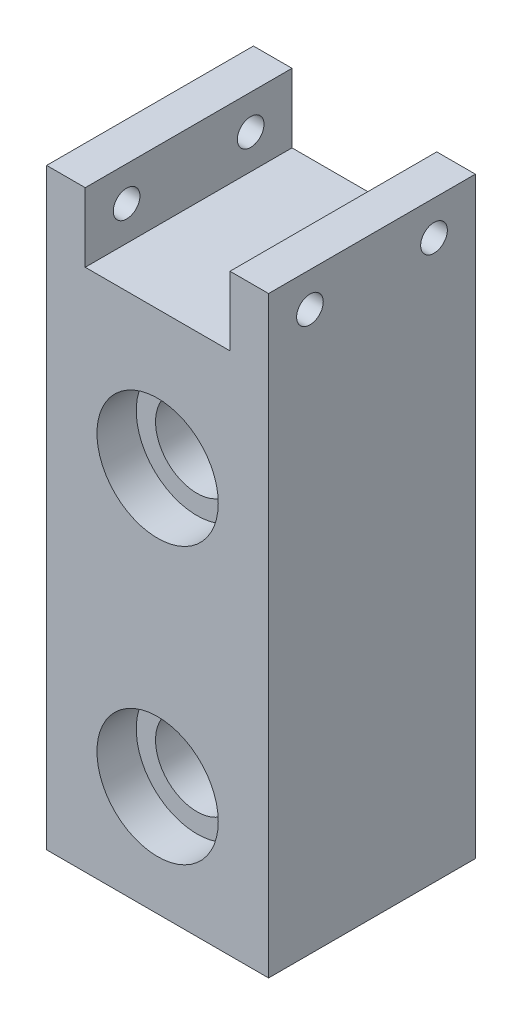
ISO-10303-21;
HEADER;
FILE_DESCRIPTION(('STEP AP214'),'2;1');
FILE_NAME('part.step','',(''),(''),'','','');
FILE_SCHEMA(('AUTOMOTIVE_DESIGN { 1 0 10303 214 1 1 1 1 }'));
ENDSEC;
DATA;
#1=APPLICATION_CONTEXT('core data for automotive mechanical design processes');
#2=APPLICATION_PROTOCOL_DEFINITION('international standard','automotive_design',2000,#1);
#3=PRODUCT_CONTEXT('',#1,'mechanical');
#4=PRODUCT('Part','Part','',(#3));
#5=PRODUCT_RELATED_PRODUCT_CATEGORY('part','',(#4));
#6=PRODUCT_DEFINITION_FORMATION('','',#4);
#7=PRODUCT_DEFINITION_CONTEXT('part definition',#1,'design');
#8=PRODUCT_DEFINITION('design','',#6,#7);
#9=PRODUCT_DEFINITION_SHAPE('','',#8);
#10=(LENGTH_UNIT() NAMED_UNIT(*) SI_UNIT(.MILLI.,.METRE.));
#11=(NAMED_UNIT(*) PLANE_ANGLE_UNIT() SI_UNIT($,.RADIAN.));
#12=(NAMED_UNIT(*) SI_UNIT($,.STERADIAN.) SOLID_ANGLE_UNIT());
#13=UNCERTAINTY_MEASURE_WITH_UNIT(LENGTH_MEASURE(1.E-05),#10,'distance_accuracy_value','');
#14=(GEOMETRIC_REPRESENTATION_CONTEXT(3) GLOBAL_UNCERTAINTY_ASSIGNED_CONTEXT((#13)) GLOBAL_UNIT_ASSIGNED_CONTEXT((#10,
#11,#12)) REPRESENTATION_CONTEXT('',''));
#15=CARTESIAN_POINT('',(0.,0.,0.));
#16=DIRECTION('',(0.,0.,1.));
#17=DIRECTION('',(1.,0.,0.));
#18=AXIS2_PLACEMENT_3D('',#15,#16,#17);
#19=CARTESIAN_POINT('',(0.,-50.8,-40.602614690566));
#20=DIRECTION('',(0.,0.,1.));
#21=DIRECTION('',(1.,0.,0.));
#22=AXIS2_PLACEMENT_3D('',#19,#20,#21);
#23=CYLINDRICAL_SURFACE('',#22,7.62);
#24=CARTESIAN_POINT('',(0.,-50.8,-11.811));
#25=DIRECTION('',(0.,0.,1.));
#26=DIRECTION('',(1.,0.,0.));
#27=AXIS2_PLACEMENT_3D('',#24,#25,#26);
#28=CIRCLE('',#27,7.62);
#29=CARTESIAN_POINT('',(7.62,-50.8,-11.811));
#30=VERTEX_POINT('',#29);
#31=EDGE_CURVE('E171',#30,#30,#28,.F.);
#32=ORIENTED_EDGE('',*,*,#31,.T.);
#33=EDGE_LOOP('',(#32));
#34=FACE_BOUND('',#33,.T.);
#35=CARTESIAN_POINT('',(0.,-50.8,11.811));
#36=DIRECTION('',(0.,0.,1.));
#37=DIRECTION('',(1.,0.,0.));
#38=AXIS2_PLACEMENT_3D('',#35,#36,#37);
#39=CIRCLE('',#38,7.62);
#40=CARTESIAN_POINT('',(7.62,-50.8,11.811));
#41=VERTEX_POINT('',#40);
#42=EDGE_CURVE('E140',#41,#41,#39,.F.);
#43=ORIENTED_EDGE('',*,*,#42,.F.);
#44=EDGE_LOOP('',(#43));
#45=FACE_BOUND('',#44,.T.);
#46=ADVANCED_FACE('F37',(#34,#45),#23,.F.);
#47=CARTESIAN_POINT('',(0.,0.,-40.602614690566));
#48=DIRECTION('',(0.,0.,1.));
#49=DIRECTION('',(1.,0.,0.));
#50=AXIS2_PLACEMENT_3D('',#47,#48,#49);
#51=CYLINDRICAL_SURFACE('',#50,7.62);
#52=CARTESIAN_POINT('',(0.,0.,-11.811));
#53=DIRECTION('',(0.,0.,1.));
#54=DIRECTION('',(1.,0.,0.));
#55=AXIS2_PLACEMENT_3D('',#52,#53,#54);
#56=CIRCLE('',#55,7.62);
#57=CARTESIAN_POINT('',(7.62,0.,-11.811));
#58=VERTEX_POINT('',#57);
#59=EDGE_CURVE('E169',#58,#58,#56,.F.);
#60=ORIENTED_EDGE('',*,*,#59,.T.);
#61=EDGE_LOOP('',(#60));
#62=FACE_BOUND('',#61,.T.);
#63=CARTESIAN_POINT('',(0.,0.,11.811));
#64=DIRECTION('',(0.,0.,1.));
#65=DIRECTION('',(1.,0.,0.));
#66=AXIS2_PLACEMENT_3D('',#63,#64,#65);
#67=CIRCLE('',#66,7.62);
#68=CARTESIAN_POINT('',(7.62,0.,11.811));
#69=VERTEX_POINT('',#68);
#70=EDGE_CURVE('E163',#69,#69,#67,.F.);
#71=ORIENTED_EDGE('',*,*,#70,.F.);
#72=EDGE_LOOP('',(#71));
#73=FACE_BOUND('',#72,.T.);
#74=ADVANCED_FACE('F222',(#62,#73),#51,.F.);
#75=CARTESIAN_POINT('',(-13.335,25.4,19.05));
#76=DIRECTION('',(-1.,0.,0.));
#77=DIRECTION('',(0.,0.,1.));
#78=AXIS2_PLACEMENT_3D('',#75,#76,#77);
#79=PLANE('',#78);
#80=CARTESIAN_POINT('',(-13.335,31.75,-11.43));
#81=DIRECTION('',(-1.,0.,0.));
#82=DIRECTION('',(0.,0.,1.));
#83=AXIS2_PLACEMENT_3D('',#80,#81,#82);
#84=CIRCLE('',#83,2.45744999999999);
#85=CARTESIAN_POINT('',(-13.335,31.75,-8.97255000000002));
#86=VERTEX_POINT('',#85);
#87=EDGE_CURVE('E321',#86,#86,#84,.T.);
#88=ORIENTED_EDGE('',*,*,#87,.T.);
#89=EDGE_LOOP('',(#88));
#90=FACE_BOUND('',#89,.T.);
#91=CARTESIAN_POINT('',(-13.335,31.75,11.43));
#92=DIRECTION('',(-1.,0.,0.));
#93=DIRECTION('',(0.,0.,1.));
#94=AXIS2_PLACEMENT_3D('',#91,#92,#93);
#95=CIRCLE('',#94,2.45744999999999);
#96=CARTESIAN_POINT('',(-13.335,31.75,13.88745));
#97=VERTEX_POINT('',#96);
#98=EDGE_CURVE('E249',#97,#97,#95,.T.);
#99=ORIENTED_EDGE('',*,*,#98,.T.);
#100=EDGE_LOOP('',(#99));
#101=FACE_BOUND('',#100,.T.);
#102=DIRECTION('',(0.,1.,0.));
#103=VECTOR('',#102,1.);
#104=CARTESIAN_POINT('',(-13.335,25.4,-19.05));
#105=LINE('',#104,#103);
#106=CARTESIAN_POINT('',(-13.335,25.4,-19.05));
#107=VERTEX_POINT('',#106);
#108=CARTESIAN_POINT('',(-13.335,38.1,-19.05));
#109=VERTEX_POINT('',#108);
#110=EDGE_CURVE('E136',#107,#109,#105,.T.);
#111=ORIENTED_EDGE('',*,*,#110,.T.);
#112=DIRECTION('',(0.,0.,-1.));
#113=VECTOR('',#112,1.);
#114=CARTESIAN_POINT('',(-13.335,38.1,19.05));
#115=LINE('',#114,#113);
#116=CARTESIAN_POINT('',(-13.335,38.1,19.05));
#117=VERTEX_POINT('',#116);
#118=EDGE_CURVE('E11',#117,#109,#115,.T.);
#119=ORIENTED_EDGE('',*,*,#118,.F.);
#120=DIRECTION('',(0.,1.,0.));
#121=VECTOR('',#120,1.);
#122=CARTESIAN_POINT('',(-13.335,25.4,19.05));
#123=LINE('',#122,#121);
#124=CARTESIAN_POINT('',(-13.335,25.4,19.05));
#125=VERTEX_POINT('',#124);
#126=EDGE_CURVE('E151',#125,#117,#123,.T.);
#127=ORIENTED_EDGE('',*,*,#126,.F.);
#128=DIRECTION('',(0.,0.,-1.));
#129=VECTOR('',#128,1.);
#130=CARTESIAN_POINT('',(-13.335,25.4,19.05));
#131=LINE('',#130,#129);
#132=EDGE_CURVE('E132',#125,#107,#131,.T.);
#133=ORIENTED_EDGE('',*,*,#132,.T.);
#134=EDGE_LOOP('',(#111,#119,#127,#133));
#135=FACE_BOUND('',#134,.T.);
#136=ADVANCED_FACE('F39',(#90,#101,#135),#79,.F.);
#137=CARTESIAN_POINT('',(-13.335,38.1,19.05));
#138=DIRECTION('',(0.,-1.,0.));
#139=DIRECTION('',(0.,0.,-1.));
#140=AXIS2_PLACEMENT_3D('',#137,#138,#139);
#141=PLANE('',#140);
#142=DIRECTION('',(-1.,0.,0.));
#143=VECTOR('',#142,1.);
#144=CARTESIAN_POINT('',(-13.335,38.1,-19.05));
#145=LINE('',#144,#143);
#146=CARTESIAN_POINT('',(-20.447,38.1,-19.05));
#147=VERTEX_POINT('',#146);
#148=EDGE_CURVE('E139',#109,#147,#145,.T.);
#149=ORIENTED_EDGE('',*,*,#148,.T.);
#150=DIRECTION('',(0.,0.,-1.));
#151=VECTOR('',#150,1.);
#152=CARTESIAN_POINT('',(-20.447,38.1,19.05));
#153=LINE('',#152,#151);
#154=CARTESIAN_POINT('',(-20.447,38.1,19.05));
#155=VERTEX_POINT('',#154);
#156=EDGE_CURVE('E47',#155,#147,#153,.T.);
#157=ORIENTED_EDGE('',*,*,#156,.F.);
#158=DIRECTION('',(-1.,0.,0.));
#159=VECTOR('',#158,1.);
#160=CARTESIAN_POINT('',(-13.335,38.1,19.05));
#161=LINE('',#160,#159);
#162=EDGE_CURVE('E99',#117,#155,#161,.T.);
#163=ORIENTED_EDGE('',*,*,#162,.F.);
#164=ORIENTED_EDGE('',*,*,#118,.T.);
#165=EDGE_LOOP('',(#149,#157,#163,#164));
#166=FACE_BOUND('',#165,.T.);
#167=ADVANCED_FACE('F366',(#166),#141,.F.);
#168=CARTESIAN_POINT('',(-20.447,38.1,19.05));
#169=DIRECTION('',(1.,0.,0.));
#170=DIRECTION('',(0.,1.,0.));
#171=AXIS2_PLACEMENT_3D('',#168,#169,#170);
#172=PLANE('',#171);
#173=CARTESIAN_POINT('',(-20.4470000000001,31.75,-11.43));
#174=DIRECTION('',(1.,0.,0.));
#175=DIRECTION('',(0.,0.,-1.));
#176=AXIS2_PLACEMENT_3D('',#173,#174,#175);
#177=CIRCLE('',#176,2.45744999999999);
#178=CARTESIAN_POINT('',(-20.4470000000001,31.75,-13.88745));
#179=VERTEX_POINT('',#178);
#180=EDGE_CURVE('E318',#179,#179,#177,.T.);
#181=ORIENTED_EDGE('',*,*,#180,.T.);
#182=EDGE_LOOP('',(#181));
#183=FACE_BOUND('',#182,.T.);
#184=CARTESIAN_POINT('',(-20.4470000000001,31.75,11.43));
#185=DIRECTION('',(1.,0.,0.));
#186=DIRECTION('',(0.,0.,-1.));
#187=AXIS2_PLACEMENT_3D('',#184,#185,#186);
#188=CIRCLE('',#187,2.45744999999999);
#189=CARTESIAN_POINT('',(-20.4470000000001,31.75,8.97255000000002));
#190=VERTEX_POINT('',#189);
#191=EDGE_CURVE('E326',#190,#190,#188,.T.);
#192=ORIENTED_EDGE('',*,*,#191,.T.);
#193=EDGE_LOOP('',(#192));
#194=FACE_BOUND('',#193,.T.);
#195=DIRECTION('',(0.,-1.,0.));
#196=VECTOR('',#195,1.);
#197=CARTESIAN_POINT('',(-20.447,38.1,-19.05));
#198=LINE('',#197,#196);
#199=CARTESIAN_POINT('',(-20.447,-71.12,-19.05));
#200=VERTEX_POINT('',#199);
#201=EDGE_CURVE('E142',#147,#200,#198,.T.);
#202=ORIENTED_EDGE('',*,*,#201,.T.);
#203=DIRECTION('',(0.,0.,-1.));
#204=VECTOR('',#203,1.);
#205=CARTESIAN_POINT('',(-20.447,-71.12,19.05));
#206=LINE('',#205,#204);
#207=CARTESIAN_POINT('',(-20.447,-71.12,19.05));
#208=VERTEX_POINT('',#207);
#209=EDGE_CURVE('E158',#208,#200,#206,.T.);
#210=ORIENTED_EDGE('',*,*,#209,.F.);
#211=DIRECTION('',(0.,-1.,0.));
#212=VECTOR('',#211,1.);
#213=CARTESIAN_POINT('',(-20.447,38.1,19.05));
#214=LINE('',#213,#212);
#215=EDGE_CURVE('E189',#155,#208,#214,.T.);
#216=ORIENTED_EDGE('',*,*,#215,.F.);
#217=ORIENTED_EDGE('',*,*,#156,.T.);
#218=EDGE_LOOP('',(#202,#210,#216,#217));
#219=FACE_BOUND('',#218,.T.);
#220=ADVANCED_FACE('F361',(#183,#194,#219),#172,.F.);
#221=CARTESIAN_POINT('',(-20.447,-71.12,19.05));
#222=DIRECTION('',(0.,1.,0.));
#223=DIRECTION('',(0.,0.,1.));
#224=AXIS2_PLACEMENT_3D('',#221,#222,#223);
#225=PLANE('',#224);
#226=DIRECTION('',(1.,0.,0.));
#227=VECTOR('',#226,1.);
#228=CARTESIAN_POINT('',(-20.447,-71.12,-19.05));
#229=LINE('',#228,#227);
#230=CARTESIAN_POINT('',(20.447,-71.12,-19.05));
#231=VERTEX_POINT('',#230);
#232=EDGE_CURVE('E144',#200,#231,#229,.T.);
#233=ORIENTED_EDGE('',*,*,#232,.T.);
#234=DIRECTION('',(0.,0.,-1.));
#235=VECTOR('',#234,1.);
#236=CARTESIAN_POINT('',(20.447,-71.12,19.05));
#237=LINE('',#236,#235);
#238=CARTESIAN_POINT('',(20.447,-71.12,19.05));
#239=VERTEX_POINT('',#238);
#240=EDGE_CURVE('E155',#239,#231,#237,.T.);
#241=ORIENTED_EDGE('',*,*,#240,.F.);
#242=DIRECTION('',(1.,0.,0.));
#243=VECTOR('',#242,1.);
#244=CARTESIAN_POINT('',(-20.447,-71.12,19.05));
#245=LINE('',#244,#243);
#246=EDGE_CURVE('E191',#208,#239,#245,.T.);
#247=ORIENTED_EDGE('',*,*,#246,.F.);
#248=ORIENTED_EDGE('',*,*,#209,.T.);
#249=EDGE_LOOP('',(#233,#241,#247,#248));
#250=FACE_BOUND('',#249,.T.);
#251=ADVANCED_FACE('F197',(#250),#225,.F.);
#252=CARTESIAN_POINT('',(20.447,38.1,19.05));
#253=DIRECTION('',(-1.,0.,0.));
#254=DIRECTION('',(0.,-1.,0.));
#255=AXIS2_PLACEMENT_3D('',#252,#253,#254);
#256=PLANE('',#255);
#257=CARTESIAN_POINT('',(20.447,31.75,-11.43));
#258=DIRECTION('',(1.,0.,0.));
#259=DIRECTION('',(0.,0.,-1.));
#260=AXIS2_PLACEMENT_3D('',#257,#258,#259);
#261=CIRCLE('',#260,2.45744999999999);
#262=CARTESIAN_POINT('',(20.447,31.75,-13.88745));
#263=VERTEX_POINT('',#262);
#264=EDGE_CURVE('E502',#263,#263,#261,.T.);
#265=ORIENTED_EDGE('',*,*,#264,.F.);
#266=EDGE_LOOP('',(#265));
#267=FACE_BOUND('',#266,.T.);
#268=CARTESIAN_POINT('',(20.447,31.75,11.43));
#269=DIRECTION('',(1.,0.,0.));
#270=DIRECTION('',(0.,0.,-1.));
#271=AXIS2_PLACEMENT_3D('',#268,#269,#270);
#272=CIRCLE('',#271,2.45744999999999);
#273=CARTESIAN_POINT('',(20.447,31.75,8.97255000000002));
#274=VERTEX_POINT('',#273);
#275=EDGE_CURVE('E323',#274,#274,#272,.T.);
#276=ORIENTED_EDGE('',*,*,#275,.F.);
#277=EDGE_LOOP('',(#276));
#278=FACE_BOUND('',#277,.T.);
#279=DIRECTION('',(0.,1.,0.));
#280=VECTOR('',#279,1.);
#281=CARTESIAN_POINT('',(20.447,38.1,-19.05));
#282=LINE('',#281,#280);
#283=CARTESIAN_POINT('',(20.447,38.1,-19.05));
#284=VERTEX_POINT('',#283);
#285=EDGE_CURVE('E146',#231,#284,#282,.T.);
#286=ORIENTED_EDGE('',*,*,#285,.T.);
#287=DIRECTION('',(0.,0.,-1.));
#288=VECTOR('',#287,1.);
#289=CARTESIAN_POINT('',(20.447,38.1,19.05));
#290=LINE('',#289,#288);
#291=CARTESIAN_POINT('',(20.447,38.1,19.05));
#292=VERTEX_POINT('',#291);
#293=EDGE_CURVE('E127',#292,#284,#290,.T.);
#294=ORIENTED_EDGE('',*,*,#293,.F.);
#295=DIRECTION('',(0.,1.,0.));
#296=VECTOR('',#295,1.);
#297=CARTESIAN_POINT('',(20.447,38.1,19.05));
#298=LINE('',#297,#296);
#299=EDGE_CURVE('E118',#239,#292,#298,.T.);
#300=ORIENTED_EDGE('',*,*,#299,.F.);
#301=ORIENTED_EDGE('',*,*,#240,.T.);
#302=EDGE_LOOP('',(#286,#294,#300,#301));
#303=FACE_BOUND('',#302,.T.);
#304=ADVANCED_FACE('F201',(#267,#278,#303),#256,.F.);
#305=CARTESIAN_POINT('',(13.335,38.1,19.05));
#306=DIRECTION('',(0.,-1.,0.));
#307=DIRECTION('',(0.,0.,-1.));
#308=AXIS2_PLACEMENT_3D('',#305,#306,#307);
#309=PLANE('',#308);
#310=DIRECTION('',(-1.,0.,0.));
#311=VECTOR('',#310,1.);
#312=CARTESIAN_POINT('',(13.335,38.1,-19.05));
#313=LINE('',#312,#311);
#314=CARTESIAN_POINT('',(13.335,38.1,-19.05));
#315=VERTEX_POINT('',#314);
#316=EDGE_CURVE('E126',#284,#315,#313,.T.);
#317=ORIENTED_EDGE('',*,*,#316,.T.);
#318=DIRECTION('',(0.,0.,-1.));
#319=VECTOR('',#318,1.);
#320=CARTESIAN_POINT('',(13.335,38.1,19.05));
#321=LINE('',#320,#319);
#322=CARTESIAN_POINT('',(13.335,38.1,19.05));
#323=VERTEX_POINT('',#322);
#324=EDGE_CURVE('E123',#323,#315,#321,.T.);
#325=ORIENTED_EDGE('',*,*,#324,.F.);
#326=DIRECTION('',(-1.,0.,0.));
#327=VECTOR('',#326,1.);
#328=CARTESIAN_POINT('',(13.335,38.1,19.05));
#329=LINE('',#328,#327);
#330=EDGE_CURVE('E112',#292,#323,#329,.T.);
#331=ORIENTED_EDGE('',*,*,#330,.F.);
#332=ORIENTED_EDGE('',*,*,#293,.T.);
#333=EDGE_LOOP('',(#317,#325,#331,#332));
#334=FACE_BOUND('',#333,.T.);
#335=ADVANCED_FACE('F124',(#334),#309,.F.);
#336=CARTESIAN_POINT('',(13.335,25.4,19.05));
#337=DIRECTION('',(1.,0.,0.));
#338=DIRECTION('',(0.,0.,-1.));
#339=AXIS2_PLACEMENT_3D('',#336,#337,#338);
#340=PLANE('',#339);
#341=CARTESIAN_POINT('',(13.335,31.75,-11.43));
#342=DIRECTION('',(1.,0.,0.));
#343=DIRECTION('',(0.,0.,-1.));
#344=AXIS2_PLACEMENT_3D('',#341,#342,#343);
#345=CIRCLE('',#344,2.45744999999999);
#346=CARTESIAN_POINT('',(13.335,31.75,-13.88745));
#347=VERTEX_POINT('',#346);
#348=EDGE_CURVE('E41',#347,#347,#345,.T.);
#349=ORIENTED_EDGE('',*,*,#348,.T.);
#350=EDGE_LOOP('',(#349));
#351=FACE_BOUND('',#350,.T.);
#352=CARTESIAN_POINT('',(13.335,31.75,11.43));
#353=DIRECTION('',(1.,0.,0.));
#354=DIRECTION('',(0.,0.,-1.));
#355=AXIS2_PLACEMENT_3D('',#352,#353,#354);
#356=CIRCLE('',#355,2.45744999999999);
#357=CARTESIAN_POINT('',(13.335,31.75,8.97255000000002));
#358=VERTEX_POINT('',#357);
#359=EDGE_CURVE('E254',#358,#358,#356,.T.);
#360=ORIENTED_EDGE('',*,*,#359,.T.);
#361=EDGE_LOOP('',(#360));
#362=FACE_BOUND('',#361,.T.);
#363=DIRECTION('',(0.,-1.,0.));
#364=VECTOR('',#363,1.);
#365=CARTESIAN_POINT('',(13.335,25.4,-19.05));
#366=LINE('',#365,#364);
#367=CARTESIAN_POINT('',(13.335,25.4,-19.05));
#368=VERTEX_POINT('',#367);
#369=EDGE_CURVE('E85',#315,#368,#366,.T.);
#370=ORIENTED_EDGE('',*,*,#369,.T.);
#371=DIRECTION('',(0.,0.,-1.));
#372=VECTOR('',#371,1.);
#373=CARTESIAN_POINT('',(13.335,25.4,19.05));
#374=LINE('',#373,#372);
#375=CARTESIAN_POINT('',(13.335,25.4,19.05));
#376=VERTEX_POINT('',#375);
#377=EDGE_CURVE('E128',#376,#368,#374,.T.);
#378=ORIENTED_EDGE('',*,*,#377,.F.);
#379=DIRECTION('',(0.,-1.,0.));
#380=VECTOR('',#379,1.);
#381=CARTESIAN_POINT('',(13.335,25.4,19.05));
#382=LINE('',#381,#380);
#383=EDGE_CURVE('E116',#323,#376,#382,.T.);
#384=ORIENTED_EDGE('',*,*,#383,.F.);
#385=ORIENTED_EDGE('',*,*,#324,.T.);
#386=EDGE_LOOP('',(#370,#378,#384,#385));
#387=FACE_BOUND('',#386,.T.);
#388=ADVANCED_FACE('F130',(#351,#362,#387),#340,.F.);
#389=CARTESIAN_POINT('',(13.335,25.4,19.05));
#390=DIRECTION('',(0.,-1.,0.));
#391=DIRECTION('',(0.,0.,-1.));
#392=AXIS2_PLACEMENT_3D('',#389,#390,#391);
#393=PLANE('',#392);
#394=DIRECTION('',(-1.,0.,0.));
#395=VECTOR('',#394,1.);
#396=CARTESIAN_POINT('',(13.335,25.4,-19.05));
#397=LINE('',#396,#395);
#398=EDGE_CURVE('E91',#368,#107,#397,.T.);
#399=ORIENTED_EDGE('',*,*,#398,.T.);
#400=ORIENTED_EDGE('',*,*,#132,.F.);
#401=DIRECTION('',(-1.,0.,0.));
#402=VECTOR('',#401,1.);
#403=CARTESIAN_POINT('',(13.335,25.4,19.05));
#404=LINE('',#403,#402);
#405=EDGE_CURVE('E56',#376,#125,#404,.T.);
#406=ORIENTED_EDGE('',*,*,#405,.F.);
#407=ORIENTED_EDGE('',*,*,#377,.T.);
#408=EDGE_LOOP('',(#399,#400,#406,#407));
#409=FACE_BOUND('',#408,.T.);
#410=ADVANCED_FACE('F209',(#409),#393,.F.);
#411=CARTESIAN_POINT('',(0.,0.,19.05));
#412=DIRECTION('',(0.,0.,1.));
#413=DIRECTION('',(1.,0.,0.));
#414=AXIS2_PLACEMENT_3D('',#411,#412,#413);
#415=PLANE('',#414);
#416=CARTESIAN_POINT('',(0.,0.,19.05));
#417=DIRECTION('',(0.,0.,1.));
#418=DIRECTION('',(1.,0.,0.));
#419=AXIS2_PLACEMENT_3D('',#416,#417,#418);
#420=CIRCLE('',#419,11.176);
#421=CARTESIAN_POINT('',(11.176,0.,19.05));
#422=VERTEX_POINT('',#421);
#423=EDGE_CURVE('E183',#422,#422,#420,.T.);
#424=ORIENTED_EDGE('',*,*,#423,.F.);
#425=EDGE_LOOP('',(#424));
#426=FACE_BOUND('',#425,.T.);
#427=CARTESIAN_POINT('',(0.,-50.8,19.05));
#428=DIRECTION('',(0.,0.,1.));
#429=DIRECTION('',(1.,0.,0.));
#430=AXIS2_PLACEMENT_3D('',#427,#428,#429);
#431=CIRCLE('',#430,11.176);
#432=CARTESIAN_POINT('',(11.176,-50.8,19.05));
#433=VERTEX_POINT('',#432);
#434=EDGE_CURVE('E174',#433,#433,#431,.T.);
#435=ORIENTED_EDGE('',*,*,#434,.F.);
#436=EDGE_LOOP('',(#435));
#437=FACE_BOUND('',#436,.T.);
#438=ORIENTED_EDGE('',*,*,#126,.T.);
#439=ORIENTED_EDGE('',*,*,#162,.T.);
#440=ORIENTED_EDGE('',*,*,#215,.T.);
#441=ORIENTED_EDGE('',*,*,#246,.T.);
#442=ORIENTED_EDGE('',*,*,#299,.T.);
#443=ORIENTED_EDGE('',*,*,#330,.T.);
#444=ORIENTED_EDGE('',*,*,#383,.T.);
#445=ORIENTED_EDGE('',*,*,#405,.T.);
#446=EDGE_LOOP('',(#438,#439,#440,#441,#442,#443,#444,#445));
#447=FACE_BOUND('',#446,.T.);
#448=ADVANCED_FACE('F114',(#426,#437,#447),#415,.T.);
#449=CARTESIAN_POINT('',(0.,0.,-19.05));
#450=DIRECTION('',(0.,0.,1.));
#451=DIRECTION('',(1.,0.,0.));
#452=AXIS2_PLACEMENT_3D('',#449,#450,#451);
#453=PLANE('',#452);
#454=CARTESIAN_POINT('',(0.,0.,-19.05));
#455=DIRECTION('',(0.,0.,1.));
#456=DIRECTION('',(1.,0.,0.));
#457=AXIS2_PLACEMENT_3D('',#454,#455,#456);
#458=CIRCLE('',#457,11.176);
#459=CARTESIAN_POINT('',(11.176,0.,-19.05));
#460=VERTEX_POINT('',#459);
#461=EDGE_CURVE('E243',#460,#460,#458,.T.);
#462=ORIENTED_EDGE('',*,*,#461,.T.);
#463=EDGE_LOOP('',(#462));
#464=FACE_BOUND('',#463,.T.);
#465=CARTESIAN_POINT('',(0.,-50.8,-19.05));
#466=DIRECTION('',(0.,0.,1.));
#467=DIRECTION('',(1.,0.,0.));
#468=AXIS2_PLACEMENT_3D('',#465,#466,#467);
#469=CIRCLE('',#468,11.176);
#470=CARTESIAN_POINT('',(11.176,-50.8,-19.05));
#471=VERTEX_POINT('',#470);
#472=EDGE_CURVE('E246',#471,#471,#469,.T.);
#473=ORIENTED_EDGE('',*,*,#472,.T.);
#474=EDGE_LOOP('',(#473));
#475=FACE_BOUND('',#474,.T.);
#476=ORIENTED_EDGE('',*,*,#110,.F.);
#477=ORIENTED_EDGE('',*,*,#398,.F.);
#478=ORIENTED_EDGE('',*,*,#369,.F.);
#479=ORIENTED_EDGE('',*,*,#316,.F.);
#480=ORIENTED_EDGE('',*,*,#285,.F.);
#481=ORIENTED_EDGE('',*,*,#232,.F.);
#482=ORIENTED_EDGE('',*,*,#201,.F.);
#483=ORIENTED_EDGE('',*,*,#148,.F.);
#484=EDGE_LOOP('',(#476,#477,#478,#479,#480,#481,#482,#483));
#485=FACE_BOUND('',#484,.T.);
#486=ADVANCED_FACE('F204',(#464,#475,#485),#453,.F.);
#487=CARTESIAN_POINT('',(0.,0.,11.811));
#488=DIRECTION('',(0.,0.,1.));
#489=DIRECTION('',(1.,0.,0.));
#490=AXIS2_PLACEMENT_3D('',#487,#488,#489);
#491=PLANE('',#490);
#492=CARTESIAN_POINT('',(0.,0.,11.811));
#493=DIRECTION('',(0.,0.,1.));
#494=DIRECTION('',(1.,0.,0.));
#495=AXIS2_PLACEMENT_3D('',#492,#493,#494);
#496=CIRCLE('',#495,11.176);
#497=CARTESIAN_POINT('',(11.176,0.,11.811));
#498=VERTEX_POINT('',#497);
#499=EDGE_CURVE('E166',#498,#498,#496,.T.);
#500=ORIENTED_EDGE('',*,*,#499,.T.);
#501=EDGE_LOOP('',(#500));
#502=FACE_BOUND('',#501,.T.);
#503=ORIENTED_EDGE('',*,*,#70,.T.);
#504=EDGE_LOOP('',(#503));
#505=FACE_BOUND('',#504,.T.);
#506=ADVANCED_FACE('F232',(#502,#505),#491,.T.);
#507=CARTESIAN_POINT('',(0.,0.,11.811));
#508=DIRECTION('',(0.,0.,1.));
#509=DIRECTION('',(1.,0.,0.));
#510=AXIS2_PLACEMENT_3D('',#507,#508,#509);
#511=CYLINDRICAL_SURFACE('',#510,11.176);
#512=ORIENTED_EDGE('',*,*,#499,.F.);
#513=EDGE_LOOP('',(#512));
#514=FACE_BOUND('',#513,.T.);
#515=ORIENTED_EDGE('',*,*,#423,.T.);
#516=EDGE_LOOP('',(#515));
#517=FACE_BOUND('',#516,.T.);
#518=ADVANCED_FACE('F237',(#514,#517),#511,.F.);
#519=CARTESIAN_POINT('',(0.,-50.8,11.811));
#520=DIRECTION('',(0.,0.,1.));
#521=DIRECTION('',(1.,0.,0.));
#522=AXIS2_PLACEMENT_3D('',#519,#520,#521);
#523=PLANE('',#522);
#524=CARTESIAN_POINT('',(0.,-50.8,11.811));
#525=DIRECTION('',(0.,0.,1.));
#526=DIRECTION('',(1.,0.,0.));
#527=AXIS2_PLACEMENT_3D('',#524,#525,#526);
#528=CIRCLE('',#527,11.176);
#529=CARTESIAN_POINT('',(11.176,-50.8,11.811));
#530=VERTEX_POINT('',#529);
#531=EDGE_CURVE('E178',#530,#530,#528,.T.);
#532=ORIENTED_EDGE('',*,*,#531,.T.);
#533=EDGE_LOOP('',(#532));
#534=FACE_BOUND('',#533,.T.);
#535=ORIENTED_EDGE('',*,*,#42,.T.);
#536=EDGE_LOOP('',(#535));
#537=FACE_BOUND('',#536,.T.);
#538=ADVANCED_FACE('F264',(#534,#537),#523,.T.);
#539=CARTESIAN_POINT('',(0.,-50.8,11.811));
#540=DIRECTION('',(0.,0.,1.));
#541=DIRECTION('',(1.,0.,0.));
#542=AXIS2_PLACEMENT_3D('',#539,#540,#541);
#543=CYLINDRICAL_SURFACE('',#542,11.176);
#544=ORIENTED_EDGE('',*,*,#531,.F.);
#545=EDGE_LOOP('',(#544));
#546=FACE_BOUND('',#545,.T.);
#547=ORIENTED_EDGE('',*,*,#434,.T.);
#548=EDGE_LOOP('',(#547));
#549=FACE_BOUND('',#548,.T.);
#550=ADVANCED_FACE('F270',(#546,#549),#543,.F.);
#551=CARTESIAN_POINT('',(0.,-50.8,-11.811));
#552=DIRECTION('',(0.,0.,1.));
#553=DIRECTION('',(1.,0.,0.));
#554=AXIS2_PLACEMENT_3D('',#551,#552,#553);
#555=PLANE('',#554);
#556=CARTESIAN_POINT('',(0.,-50.8,-11.811));
#557=DIRECTION('',(0.,0.,1.));
#558=DIRECTION('',(1.,0.,0.));
#559=AXIS2_PLACEMENT_3D('',#556,#557,#558);
#560=CIRCLE('',#559,11.176);
#561=CARTESIAN_POINT('',(11.176,-50.8,-11.811));
#562=VERTEX_POINT('',#561);
#563=EDGE_CURVE('E248',#562,#562,#560,.T.);
#564=ORIENTED_EDGE('',*,*,#563,.F.);
#565=EDGE_LOOP('',(#564));
#566=FACE_BOUND('',#565,.T.);
#567=ORIENTED_EDGE('',*,*,#31,.F.);
#568=EDGE_LOOP('',(#567));
#569=FACE_BOUND('',#568,.T.);
#570=ADVANCED_FACE('F276',(#566,#569),#555,.F.);
#571=CARTESIAN_POINT('',(0.,-50.8,-11.811));
#572=DIRECTION('',(0.,0.,-1.));
#573=DIRECTION('',(-1.,0.,0.));
#574=AXIS2_PLACEMENT_3D('',#571,#572,#573);
#575=CYLINDRICAL_SURFACE('',#574,11.176);
#576=ORIENTED_EDGE('',*,*,#563,.T.);
#577=EDGE_LOOP('',(#576));
#578=FACE_BOUND('',#577,.T.);
#579=ORIENTED_EDGE('',*,*,#472,.F.);
#580=EDGE_LOOP('',(#579));
#581=FACE_BOUND('',#580,.T.);
#582=ADVANCED_FACE('F281',(#578,#581),#575,.F.);
#583=CARTESIAN_POINT('',(0.,0.,-11.811));
#584=DIRECTION('',(0.,0.,1.));
#585=DIRECTION('',(1.,0.,0.));
#586=AXIS2_PLACEMENT_3D('',#583,#584,#585);
#587=PLANE('',#586);
#588=CARTESIAN_POINT('',(0.,0.,-11.811));
#589=DIRECTION('',(0.,0.,1.));
#590=DIRECTION('',(1.,0.,0.));
#591=AXIS2_PLACEMENT_3D('',#588,#589,#590);
#592=CIRCLE('',#591,11.176);
#593=CARTESIAN_POINT('',(11.176,0.,-11.811));
#594=VERTEX_POINT('',#593);
#595=EDGE_CURVE('E172',#594,#594,#592,.T.);
#596=ORIENTED_EDGE('',*,*,#595,.F.);
#597=EDGE_LOOP('',(#596));
#598=FACE_BOUND('',#597,.T.);
#599=ORIENTED_EDGE('',*,*,#59,.F.);
#600=EDGE_LOOP('',(#599));
#601=FACE_BOUND('',#600,.T.);
#602=ADVANCED_FACE('F290',(#598,#601),#587,.F.);
#603=CARTESIAN_POINT('',(0.,0.,-11.811));
#604=DIRECTION('',(0.,0.,-1.));
#605=DIRECTION('',(-1.,0.,0.));
#606=AXIS2_PLACEMENT_3D('',#603,#604,#605);
#607=CYLINDRICAL_SURFACE('',#606,11.176);
#608=ORIENTED_EDGE('',*,*,#595,.T.);
#609=EDGE_LOOP('',(#608));
#610=FACE_BOUND('',#609,.T.);
#611=ORIENTED_EDGE('',*,*,#461,.F.);
#612=EDGE_LOOP('',(#611));
#613=FACE_BOUND('',#612,.T.);
#614=ADVANCED_FACE('F295',(#610,#613),#607,.F.);
#615=CARTESIAN_POINT('',(20.447,31.75,11.43));
#616=DIRECTION('',(1.,0.,0.));
#617=DIRECTION('',(0.,0.,-1.));
#618=AXIS2_PLACEMENT_3D('',#615,#616,#617);
#619=CYLINDRICAL_SURFACE('',#618,2.45744999999999);
#620=ORIENTED_EDGE('',*,*,#275,.T.);
#621=EDGE_LOOP('',(#620));
#622=FACE_BOUND('',#621,.T.);
#623=ORIENTED_EDGE('',*,*,#359,.F.);
#624=EDGE_LOOP('',(#623));
#625=FACE_BOUND('',#624,.T.);
#626=ADVANCED_FACE('F298',(#622,#625),#619,.F.);
#627=ORIENTED_EDGE('',*,*,#191,.F.);
#628=EDGE_LOOP('',(#627));
#629=FACE_BOUND('',#628,.T.);
#630=ORIENTED_EDGE('',*,*,#98,.F.);
#631=EDGE_LOOP('',(#630));
#632=FACE_BOUND('',#631,.T.);
#633=ADVANCED_FACE('F303',(#629,#632),#619,.F.);
#634=CARTESIAN_POINT('',(20.447,31.75,-11.43));
#635=DIRECTION('',(1.,0.,0.));
#636=DIRECTION('',(0.,0.,-1.));
#637=AXIS2_PLACEMENT_3D('',#634,#635,#636);
#638=CYLINDRICAL_SURFACE('',#637,2.45744999999999);
#639=ORIENTED_EDGE('',*,*,#264,.T.);
#640=EDGE_LOOP('',(#639));
#641=FACE_BOUND('',#640,.T.);
#642=ORIENTED_EDGE('',*,*,#348,.F.);
#643=EDGE_LOOP('',(#642));
#644=FACE_BOUND('',#643,.T.);
#645=ADVANCED_FACE('F306',(#641,#644),#638,.F.);
#646=ORIENTED_EDGE('',*,*,#180,.F.);
#647=EDGE_LOOP('',(#646));
#648=FACE_BOUND('',#647,.T.);
#649=ORIENTED_EDGE('',*,*,#87,.F.);
#650=EDGE_LOOP('',(#649));
#651=FACE_BOUND('',#650,.T.);
#652=ADVANCED_FACE('F308',(#648,#651),#638,.F.);
#653=CLOSED_SHELL('',(#46,#74,#136,#167,#220,#251,#304,#335,#388,#410,#448,#486,#506,#518,#538,
#550,#570,#582,#602,#614,#626,#633,#645,#652));
#654=MANIFOLD_SOLID_BREP('B2',#653);
#655=ADVANCED_BREP_SHAPE_REPRESENTATION('',(#18,#654),#14);
#656=SHAPE_DEFINITION_REPRESENTATION(#9,#655);
ENDSEC;
END-ISO-10303-21;
